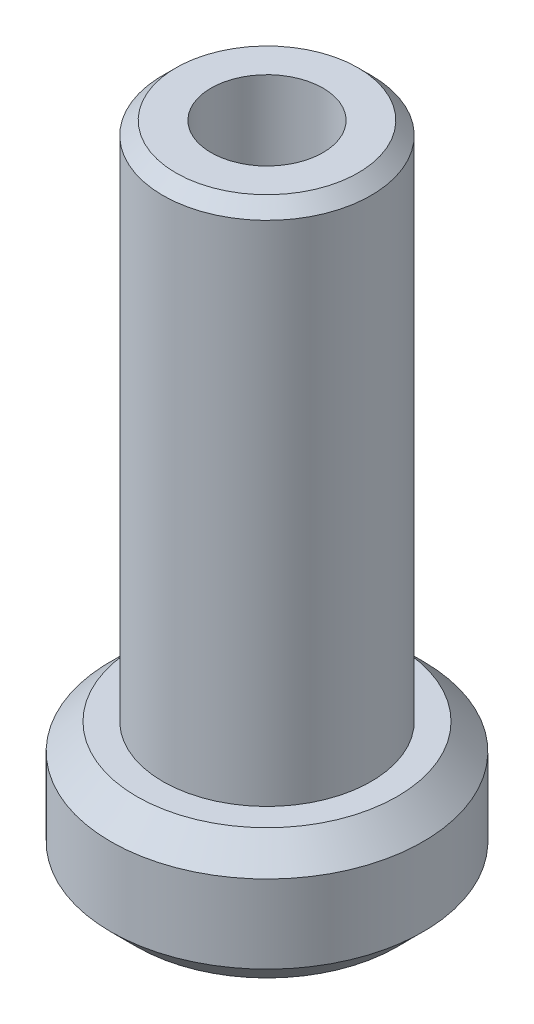
ISO-10303-21;
HEADER;
FILE_DESCRIPTION(('STEP AP214'),'2;1');
FILE_NAME('part.step','',(''),(''),'','','');
FILE_SCHEMA(('AUTOMOTIVE_DESIGN { 1 0 10303 214 1 1 1 1 }'));
ENDSEC;
DATA;
#1=APPLICATION_CONTEXT('core data for automotive mechanical design processes');
#2=APPLICATION_PROTOCOL_DEFINITION('international standard','automotive_design',2000,#1);
#3=PRODUCT_CONTEXT('',#1,'mechanical');
#4=PRODUCT('Part','Part','',(#3));
#5=PRODUCT_RELATED_PRODUCT_CATEGORY('part','',(#4));
#6=PRODUCT_DEFINITION_FORMATION('','',#4);
#7=PRODUCT_DEFINITION_CONTEXT('part definition',#1,'design');
#8=PRODUCT_DEFINITION('design','',#6,#7);
#9=PRODUCT_DEFINITION_SHAPE('','',#8);
#10=(LENGTH_UNIT() NAMED_UNIT(*) SI_UNIT(.MILLI.,.METRE.));
#11=(NAMED_UNIT(*) PLANE_ANGLE_UNIT() SI_UNIT($,.RADIAN.));
#12=(NAMED_UNIT(*) SI_UNIT($,.STERADIAN.) SOLID_ANGLE_UNIT());
#13=UNCERTAINTY_MEASURE_WITH_UNIT(LENGTH_MEASURE(1.E-05),#10,'distance_accuracy_value','');
#14=(GEOMETRIC_REPRESENTATION_CONTEXT(3) GLOBAL_UNCERTAINTY_ASSIGNED_CONTEXT((#13)) GLOBAL_UNIT_ASSIGNED_CONTEXT((#10,
#11,#12)) REPRESENTATION_CONTEXT('',''));
#15=CARTESIAN_POINT('',(0.,0.,0.));
#16=DIRECTION('',(0.,0.,1.));
#17=DIRECTION('',(1.,0.,0.));
#18=AXIS2_PLACEMENT_3D('',#15,#16,#17);
#19=CARTESIAN_POINT('',(-6.,0.,0.));
#20=DIRECTION('',(0.,-1.,0.));
#21=DIRECTION('',(0.,0.,-1.));
#22=AXIS2_PLACEMENT_3D('',#19,#20,#21);
#23=PLANE('',#22);
#24=CARTESIAN_POINT('',(0.,0.,0.));
#25=DIRECTION('',(0.,-1.,0.));
#26=DIRECTION('',(0.,0.,-1.));
#27=AXIS2_PLACEMENT_3D('',#24,#25,#26);
#28=CIRCLE('',#27,4.99999999999999);
#29=CARTESIAN_POINT('',(0.,0.,-4.99999999999999));
#30=VERTEX_POINT('',#29);
#31=EDGE_CURVE('E46',#30,#30,#28,.T.);
#32=ORIENTED_EDGE('',*,*,#31,.T.);
#33=EDGE_LOOP('',(#32));
#34=FACE_BOUND('',#33,.T.);
#35=CARTESIAN_POINT('',(0.,0.,0.));
#36=DIRECTION('',(0.,-1.,0.));
#37=DIRECTION('',(0.,0.,-1.));
#38=AXIS2_PLACEMENT_3D('',#35,#36,#37);
#39=CIRCLE('',#38,4.);
#40=CARTESIAN_POINT('',(0.,0.,-4.));
#41=VERTEX_POINT('',#40);
#42=EDGE_CURVE('E73',#41,#41,#39,.T.);
#43=ORIENTED_EDGE('',*,*,#42,.F.);
#44=EDGE_LOOP('',(#43));
#45=FACE_BOUND('',#44,.T.);
#46=ADVANCED_FACE('F34',(#34,#45),#23,.T.);
#47=CARTESIAN_POINT('',(0.,25.,0.));
#48=DIRECTION('',(0.,1.,0.));
#49=DIRECTION('',(0.,0.,1.));
#50=AXIS2_PLACEMENT_3D('',#47,#48,#49);
#51=PLANE('',#50);
#52=CARTESIAN_POINT('',(0.,25.,0.));
#53=DIRECTION('',(0.,1.,0.));
#54=DIRECTION('',(0.,0.,1.));
#55=AXIS2_PLACEMENT_3D('',#52,#53,#54);
#56=CIRCLE('',#55,3.5);
#57=CARTESIAN_POINT('',(0.,25.,3.5));
#58=VERTEX_POINT('',#57);
#59=EDGE_CURVE('E42',#58,#58,#56,.T.);
#60=ORIENTED_EDGE('',*,*,#59,.T.);
#61=EDGE_LOOP('',(#60));
#62=FACE_BOUND('',#61,.T.);
#63=CARTESIAN_POINT('',(0.,25.,0.));
#64=DIRECTION('',(0.,-1.,0.));
#65=DIRECTION('',(0.,0.,-1.));
#66=AXIS2_PLACEMENT_3D('',#63,#64,#65);
#67=CIRCLE('',#66,2.14999999999999);
#68=CARTESIAN_POINT('',(0.,25.,-2.14999999999999));
#69=VERTEX_POINT('',#68);
#70=EDGE_CURVE('E64',#69,#69,#67,.T.);
#71=ORIENTED_EDGE('',*,*,#70,.T.);
#72=EDGE_LOOP('',(#71));
#73=FACE_BOUND('',#72,.T.);
#74=ADVANCED_FACE('F80',(#62,#73),#51,.T.);
#75=CARTESIAN_POINT('',(0.,0.,0.));
#76=DIRECTION('',(0.,1.,0.));
#77=DIRECTION('',(0.,0.,1.));
#78=AXIS2_PLACEMENT_3D('',#75,#76,#77);
#79=CYLINDRICAL_SURFACE('',#78,4.);
#80=CARTESIAN_POINT('',(0.,24.5,0.));
#81=DIRECTION('',(0.,1.,0.));
#82=DIRECTION('',(0.,0.,1.));
#83=AXIS2_PLACEMENT_3D('',#80,#81,#82);
#84=CIRCLE('',#83,4.);
#85=CARTESIAN_POINT('',(0.,24.5,4.));
#86=VERTEX_POINT('',#85);
#87=EDGE_CURVE('E10',#86,#86,#84,.F.);
#88=ORIENTED_EDGE('',*,*,#87,.T.);
#89=EDGE_LOOP('',(#88));
#90=FACE_BOUND('',#89,.T.);
#91=CARTESIAN_POINT('',(0.,5.,0.));
#92=DIRECTION('',(0.,1.,0.));
#93=DIRECTION('',(0.,0.,1.));
#94=AXIS2_PLACEMENT_3D('',#91,#92,#93);
#95=CIRCLE('',#94,4.);
#96=CARTESIAN_POINT('',(0.,5.,4.));
#97=VERTEX_POINT('',#96);
#98=EDGE_CURVE('E61',#97,#97,#95,.T.);
#99=ORIENTED_EDGE('',*,*,#98,.T.);
#100=EDGE_LOOP('',(#99));
#101=FACE_BOUND('',#100,.T.);
#102=ADVANCED_FACE('F86',(#90,#101),#79,.T.);
#103=CARTESIAN_POINT('',(-4.,5.,0.));
#104=DIRECTION('',(0.,1.,0.));
#105=DIRECTION('',(0.,0.,1.));
#106=AXIS2_PLACEMENT_3D('',#103,#104,#105);
#107=PLANE('',#106);
#108=CARTESIAN_POINT('',(0.,5.,0.));
#109=DIRECTION('',(0.,1.,0.));
#110=DIRECTION('',(0.,0.,1.));
#111=AXIS2_PLACEMENT_3D('',#108,#109,#110);
#112=CIRCLE('',#111,5.);
#113=CARTESIAN_POINT('',(0.,5.,5.));
#114=VERTEX_POINT('',#113);
#115=EDGE_CURVE('E58',#114,#114,#112,.T.);
#116=ORIENTED_EDGE('',*,*,#115,.T.);
#117=EDGE_LOOP('',(#116));
#118=FACE_BOUND('',#117,.T.);
#119=ORIENTED_EDGE('',*,*,#98,.F.);
#120=EDGE_LOOP('',(#119));
#121=FACE_BOUND('',#120,.T.);
#122=ADVANCED_FACE('F113',(#118,#121),#107,.T.);
#123=CARTESIAN_POINT('',(0.,0.,0.));
#124=DIRECTION('',(0.,1.,0.));
#125=DIRECTION('',(0.,0.,1.));
#126=AXIS2_PLACEMENT_3D('',#123,#124,#125);
#127=CYLINDRICAL_SURFACE('',#126,6.);
#128=CARTESIAN_POINT('',(0.,4.,0.));
#129=DIRECTION('',(0.,1.,0.));
#130=DIRECTION('',(0.,0.,1.));
#131=AXIS2_PLACEMENT_3D('',#128,#129,#130);
#132=CIRCLE('',#131,6.);
#133=CARTESIAN_POINT('',(0.,4.,6.));
#134=VERTEX_POINT('',#133);
#135=EDGE_CURVE('E50',#134,#134,#132,.F.);
#136=ORIENTED_EDGE('',*,*,#135,.T.);
#137=EDGE_LOOP('',(#136));
#138=FACE_BOUND('',#137,.T.);
#139=CARTESIAN_POINT('',(0.,1.,0.));
#140=DIRECTION('',(0.,-1.,0.));
#141=DIRECTION('',(0.,0.,-1.));
#142=AXIS2_PLACEMENT_3D('',#139,#140,#141);
#143=CIRCLE('',#142,6.);
#144=CARTESIAN_POINT('',(0.,1.,-6.));
#145=VERTEX_POINT('',#144);
#146=EDGE_CURVE('E55',#145,#145,#143,.F.);
#147=ORIENTED_EDGE('',*,*,#146,.T.);
#148=EDGE_LOOP('',(#147));
#149=FACE_BOUND('',#148,.T.);
#150=ADVANCED_FACE('F110',(#138,#149),#127,.T.);
#151=CARTESIAN_POINT('',(0.,0.,0.));
#152=DIRECTION('',(0.,-1.,0.));
#153=DIRECTION('',(0.,0.,-1.));
#154=AXIS2_PLACEMENT_3D('',#151,#152,#153);
#155=CYLINDRICAL_SURFACE('',#154,2.15);
#156=ORIENTED_EDGE('',*,*,#70,.F.);
#157=EDGE_LOOP('',(#156));
#158=FACE_BOUND('',#157,.T.);
#159=CARTESIAN_POINT('',(0.,2.,0.));
#160=DIRECTION('',(0.,-1.,0.));
#161=DIRECTION('',(0.,0.,-1.));
#162=AXIS2_PLACEMENT_3D('',#159,#160,#161);
#163=CIRCLE('',#162,2.15);
#164=CARTESIAN_POINT('',(0.,2.,-2.15));
#165=VERTEX_POINT('',#164);
#166=EDGE_CURVE('E67',#165,#165,#163,.T.);
#167=ORIENTED_EDGE('',*,*,#166,.T.);
#168=EDGE_LOOP('',(#167));
#169=FACE_BOUND('',#168,.T.);
#170=ADVANCED_FACE('F112',(#158,#169),#155,.F.);
#171=CARTESIAN_POINT('',(2.15,2.,0.));
#172=DIRECTION('',(0.,1.,0.));
#173=DIRECTION('',(0.,0.,1.));
#174=AXIS2_PLACEMENT_3D('',#171,#172,#173);
#175=PLANE('',#174);
#176=ORIENTED_EDGE('',*,*,#166,.F.);
#177=EDGE_LOOP('',(#176));
#178=FACE_BOUND('',#177,.T.);
#179=CARTESIAN_POINT('',(0.,2.,0.));
#180=DIRECTION('',(0.,-1.,0.));
#181=DIRECTION('',(0.,0.,-1.));
#182=AXIS2_PLACEMENT_3D('',#179,#180,#181);
#183=CIRCLE('',#182,4.);
#184=CARTESIAN_POINT('',(0.,2.,-4.));
#185=VERTEX_POINT('',#184);
#186=EDGE_CURVE('E70',#185,#185,#183,.T.);
#187=ORIENTED_EDGE('',*,*,#186,.T.);
#188=EDGE_LOOP('',(#187));
#189=FACE_BOUND('',#188,.T.);
#190=ADVANCED_FACE('F120',(#178,#189),#175,.F.);
#191=CARTESIAN_POINT('',(0.,0.,0.));
#192=DIRECTION('',(0.,-1.,0.));
#193=DIRECTION('',(0.,0.,-1.));
#194=AXIS2_PLACEMENT_3D('',#191,#192,#193);
#195=CYLINDRICAL_SURFACE('',#194,4.);
#196=ORIENTED_EDGE('',*,*,#186,.F.);
#197=EDGE_LOOP('',(#196));
#198=FACE_BOUND('',#197,.T.);
#199=ORIENTED_EDGE('',*,*,#42,.T.);
#200=EDGE_LOOP('',(#199));
#201=FACE_BOUND('',#200,.T.);
#202=ADVANCED_FACE('F77',(#198,#201),#195,.F.);
#203=CARTESIAN_POINT('',(0.,5.,0.));
#204=DIRECTION('',(0.,-1.,0.));
#205=DIRECTION('',(0.,0.,-1.));
#206=AXIS2_PLACEMENT_3D('',#203,#204,#205);
#207=CONICAL_SURFACE('',#206,5.,0.785398163397447);
#208=ORIENTED_EDGE('',*,*,#135,.F.);
#209=EDGE_LOOP('',(#208));
#210=FACE_BOUND('',#209,.T.);
#211=ORIENTED_EDGE('',*,*,#115,.F.);
#212=EDGE_LOOP('',(#211));
#213=FACE_BOUND('',#212,.T.);
#214=ADVANCED_FACE('F91',(#210,#213),#207,.T.);
#215=CARTESIAN_POINT('',(0.,1.,0.));
#216=DIRECTION('',(0.,1.,0.));
#217=DIRECTION('',(0.,0.,1.));
#218=AXIS2_PLACEMENT_3D('',#215,#216,#217);
#219=CONICAL_SURFACE('',#218,6.,0.785398163397451);
#220=ORIENTED_EDGE('',*,*,#31,.F.);
#221=EDGE_LOOP('',(#220));
#222=FACE_BOUND('',#221,.T.);
#223=ORIENTED_EDGE('',*,*,#146,.F.);
#224=EDGE_LOOP('',(#223));
#225=FACE_BOUND('',#224,.T.);
#226=ADVANCED_FACE('F96',(#222,#225),#219,.T.);
#227=CARTESIAN_POINT('',(0.,25.,0.));
#228=DIRECTION('',(0.,-1.,0.));
#229=DIRECTION('',(0.,0.,-1.));
#230=AXIS2_PLACEMENT_3D('',#227,#228,#229);
#231=CONICAL_SURFACE('',#230,3.5,0.785398163397445);
#232=ORIENTED_EDGE('',*,*,#87,.F.);
#233=EDGE_LOOP('',(#232));
#234=FACE_BOUND('',#233,.T.);
#235=ORIENTED_EDGE('',*,*,#59,.F.);
#236=EDGE_LOOP('',(#235));
#237=FACE_BOUND('',#236,.T.);
#238=ADVANCED_FACE('F37',(#234,#237),#231,.T.);
#239=CLOSED_SHELL('',(#46,#74,#102,#122,#150,#170,#190,#202,#214,#226,#238));
#240=MANIFOLD_SOLID_BREP('B2',#239);
#241=ADVANCED_BREP_SHAPE_REPRESENTATION('',(#18,#240),#14);
#242=SHAPE_DEFINITION_REPRESENTATION(#9,#241);
ENDSEC;
END-ISO-10303-21;
